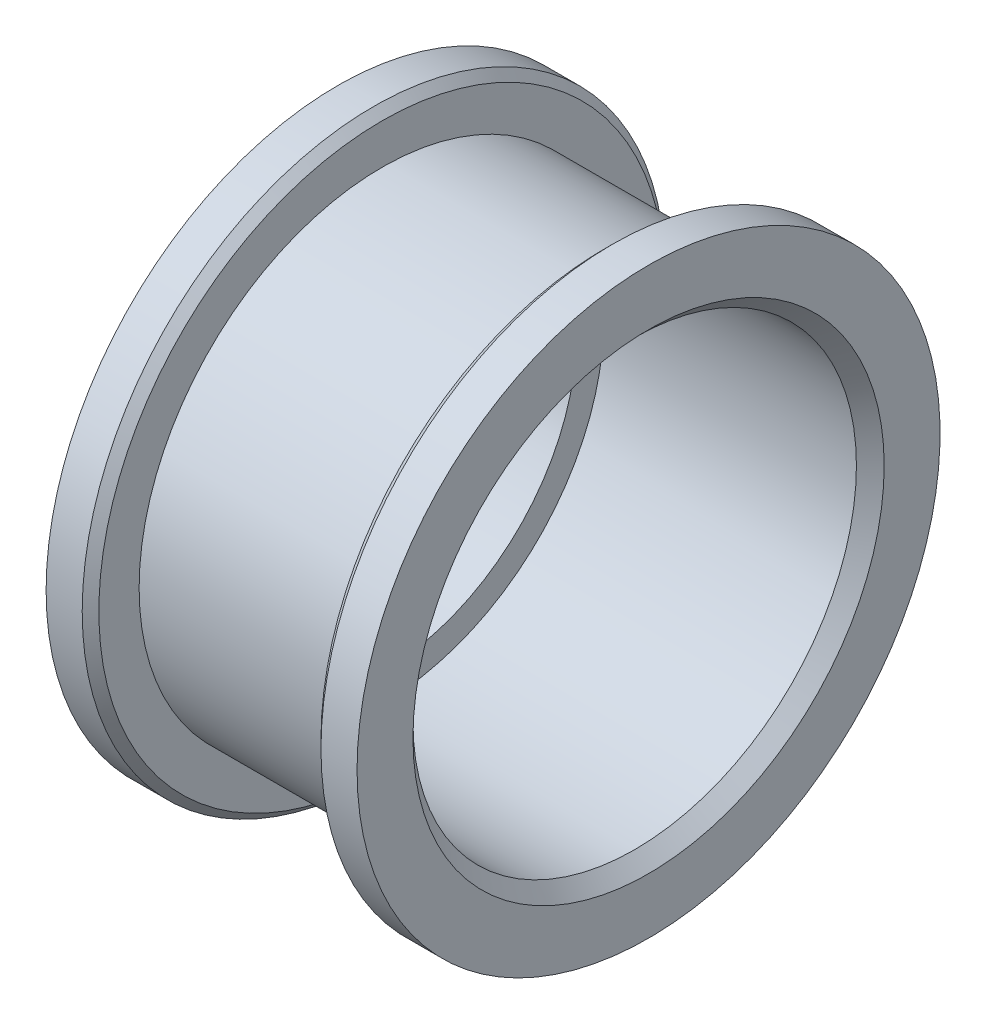
ISO-10303-21;
HEADER;
FILE_DESCRIPTION(('STEP AP214'),'2;1');
FILE_NAME('part.step','',(''),(''),'','','');
FILE_SCHEMA(('AUTOMOTIVE_DESIGN { 1 0 10303 214 1 1 1 1 }'));
ENDSEC;
DATA;
#1=APPLICATION_CONTEXT('core data for automotive mechanical design processes');
#2=APPLICATION_PROTOCOL_DEFINITION('international standard','automotive_design',2000,#1);
#3=PRODUCT_CONTEXT('',#1,'mechanical');
#4=PRODUCT('Part','Part','',(#3));
#5=PRODUCT_RELATED_PRODUCT_CATEGORY('part','',(#4));
#6=PRODUCT_DEFINITION_FORMATION('','',#4);
#7=PRODUCT_DEFINITION_CONTEXT('part definition',#1,'design');
#8=PRODUCT_DEFINITION('design','',#6,#7);
#9=PRODUCT_DEFINITION_SHAPE('','',#8);
#10=(LENGTH_UNIT() NAMED_UNIT(*) SI_UNIT(.MILLI.,.METRE.));
#11=(NAMED_UNIT(*) PLANE_ANGLE_UNIT() SI_UNIT($,.RADIAN.));
#12=(NAMED_UNIT(*) SI_UNIT($,.STERADIAN.) SOLID_ANGLE_UNIT());
#13=UNCERTAINTY_MEASURE_WITH_UNIT(LENGTH_MEASURE(1.E-05),#10,'distance_accuracy_value','');
#14=(GEOMETRIC_REPRESENTATION_CONTEXT(3) GLOBAL_UNCERTAINTY_ASSIGNED_CONTEXT((#13)) GLOBAL_UNIT_ASSIGNED_CONTEXT((#10,
#11,#12)) REPRESENTATION_CONTEXT('',''));
#15=CARTESIAN_POINT('',(0.,0.,0.));
#16=DIRECTION('',(0.,0.,1.));
#17=DIRECTION('',(1.,0.,0.));
#18=AXIS2_PLACEMENT_3D('',#15,#16,#17);
#19=CARTESIAN_POINT('',(6.16,0.,0.));
#20=DIRECTION('',(-1.,0.,0.));
#21=DIRECTION('',(0.,0.,1.));
#22=AXIS2_PLACEMENT_3D('',#19,#20,#21);
#23=CYLINDRICAL_SURFACE('',#22,8.75);
#24=CARTESIAN_POINT('',(4.,0.,0.));
#25=DIRECTION('',(-1.,0.,0.));
#26=DIRECTION('',(0.,0.,1.));
#27=AXIS2_PLACEMENT_3D('',#24,#25,#26);
#28=CIRCLE('',#27,8.75);
#29=CARTESIAN_POINT('',(4.,0.,8.75));
#30=VERTEX_POINT('',#29);
#31=EDGE_CURVE('E53',#30,#30,#28,.F.);
#32=ORIENTED_EDGE('',*,*,#31,.F.);
#33=EDGE_LOOP('',(#32));
#34=FACE_BOUND('',#33,.T.);
#35=CARTESIAN_POINT('',(-4.,0.,0.));
#36=DIRECTION('',(-1.,0.,0.));
#37=DIRECTION('',(0.,0.,1.));
#38=AXIS2_PLACEMENT_3D('',#35,#36,#37);
#39=CIRCLE('',#38,8.75);
#40=CARTESIAN_POINT('',(-4.,0.,8.75));
#41=VERTEX_POINT('',#40);
#42=EDGE_CURVE('E17',#41,#41,#39,.F.);
#43=ORIENTED_EDGE('',*,*,#42,.T.);
#44=EDGE_LOOP('',(#43));
#45=FACE_BOUND('',#44,.T.);
#46=ADVANCED_FACE('F14',(#34,#45),#23,.T.);
#47=CARTESIAN_POINT('',(-4.,0.,0.));
#48=DIRECTION('',(-1.,0.,0.));
#49=DIRECTION('',(0.,0.,1.));
#50=AXIS2_PLACEMENT_3D('',#47,#48,#49);
#51=PLANE('',#50);
#52=ORIENTED_EDGE('',*,*,#42,.F.);
#53=EDGE_LOOP('',(#52));
#54=FACE_BOUND('',#53,.T.);
#55=CARTESIAN_POINT('',(-4.00000000000038,0.,0.));
#56=DIRECTION('',(-1.,0.,0.));
#57=DIRECTION('',(0.,-1.,0.));
#58=AXIS2_PLACEMENT_3D('',#55,#56,#57);
#59=CIRCLE('',#58,10.1999999999996);
#60=CARTESIAN_POINT('',(-4.00000000000038,-10.1999999999996,0.));
#61=VERTEX_POINT('',#60);
#62=EDGE_CURVE('E51',#61,#61,#59,.T.);
#63=ORIENTED_EDGE('',*,*,#62,.F.);
#64=EDGE_LOOP('',(#63));
#65=FACE_BOUND('',#64,.T.);
#66=ADVANCED_FACE('F61',(#54,#65),#51,.F.);
#67=CARTESIAN_POINT('',(4.,0.,0.));
#68=DIRECTION('',(-1.,0.,0.));
#69=DIRECTION('',(0.,0.,1.));
#70=AXIS2_PLACEMENT_3D('',#67,#68,#69);
#71=PLANE('',#70);
#72=ORIENTED_EDGE('',*,*,#31,.T.);
#73=EDGE_LOOP('',(#72));
#74=FACE_BOUND('',#73,.T.);
#75=CARTESIAN_POINT('',(4.00000000000238,0.,0.));
#76=DIRECTION('',(1.,0.,0.));
#77=DIRECTION('',(0.,0.,-1.));
#78=AXIS2_PLACEMENT_3D('',#75,#76,#77);
#79=CIRCLE('',#78,10.1999999999976);
#80=CARTESIAN_POINT('',(4.00000000000238,0.,-10.1999999999976));
#81=VERTEX_POINT('',#80);
#82=EDGE_CURVE('E47',#81,#81,#79,.T.);
#83=ORIENTED_EDGE('',*,*,#82,.F.);
#84=EDGE_LOOP('',(#83));
#85=FACE_BOUND('',#84,.T.);
#86=ADVANCED_FACE('F64',(#74,#85),#71,.T.);
#87=CARTESIAN_POINT('',(-4.29999999999962,0.,0.));
#88=DIRECTION('',(-1.,0.,0.));
#89=DIRECTION('',(0.,-1.,0.));
#90=AXIS2_PLACEMENT_3D('',#87,#88,#89);
#91=CONICAL_SURFACE('',#90,10.5000000000004,0.785398163399998);
#92=ORIENTED_EDGE('',*,*,#62,.T.);
#93=EDGE_LOOP('',(#92));
#94=FACE_BOUND('',#93,.T.);
#95=CARTESIAN_POINT('',(-4.3,0.,0.));
#96=DIRECTION('',(-1.,0.,0.));
#97=DIRECTION('',(0.,0.,1.));
#98=AXIS2_PLACEMENT_3D('',#95,#96,#97);
#99=CIRCLE('',#98,10.5);
#100=CARTESIAN_POINT('',(-4.3,0.,10.5));
#101=VERTEX_POINT('',#100);
#102=EDGE_CURVE('E50',#101,#101,#99,.T.);
#103=ORIENTED_EDGE('',*,*,#102,.F.);
#104=EDGE_LOOP('',(#103));
#105=FACE_BOUND('',#104,.T.);
#106=ADVANCED_FACE('F67',(#94,#105),#91,.T.);
#107=CARTESIAN_POINT('',(4.30000000000161,0.,0.));
#108=DIRECTION('',(1.,0.,0.));
#109=DIRECTION('',(0.,0.,-1.));
#110=AXIS2_PLACEMENT_3D('',#107,#108,#109);
#111=CONICAL_SURFACE('',#110,10.4999999999984,0.785398163400004);
#112=CARTESIAN_POINT('',(4.3,0.,0.));
#113=DIRECTION('',(-1.,0.,0.));
#114=DIRECTION('',(0.,0.,1.));
#115=AXIS2_PLACEMENT_3D('',#112,#113,#114);
#116=CIRCLE('',#115,10.5);
#117=CARTESIAN_POINT('',(4.3,0.,10.5));
#118=VERTEX_POINT('',#117);
#119=EDGE_CURVE('E46',#118,#118,#116,.F.);
#120=ORIENTED_EDGE('',*,*,#119,.F.);
#121=EDGE_LOOP('',(#120));
#122=FACE_BOUND('',#121,.T.);
#123=ORIENTED_EDGE('',*,*,#82,.T.);
#124=EDGE_LOOP('',(#123));
#125=FACE_BOUND('',#124,.T.);
#126=ADVANCED_FACE('F70',(#122,#125),#111,.T.);
#127=CARTESIAN_POINT('',(6.16,0.,0.));
#128=DIRECTION('',(-1.,0.,0.));
#129=DIRECTION('',(0.,0.,1.));
#130=AXIS2_PLACEMENT_3D('',#127,#128,#129);
#131=CYLINDRICAL_SURFACE('',#130,10.5);
#132=CARTESIAN_POINT('',(-5.6,0.,0.));
#133=DIRECTION('',(-1.,0.,0.));
#134=DIRECTION('',(0.,0.,1.));
#135=AXIS2_PLACEMENT_3D('',#132,#133,#134);
#136=CIRCLE('',#135,10.5);
#137=CARTESIAN_POINT('',(-5.6,0.,10.5));
#138=VERTEX_POINT('',#137);
#139=EDGE_CURVE('E43',#138,#138,#136,.T.);
#140=ORIENTED_EDGE('',*,*,#139,.F.);
#141=EDGE_LOOP('',(#140));
#142=FACE_BOUND('',#141,.T.);
#143=ORIENTED_EDGE('',*,*,#102,.T.);
#144=EDGE_LOOP('',(#143));
#145=FACE_BOUND('',#144,.T.);
#146=ADVANCED_FACE('F87',(#142,#145),#131,.T.);
#147=CARTESIAN_POINT('',(6.16,0.,0.));
#148=DIRECTION('',(-1.,0.,0.));
#149=DIRECTION('',(0.,0.,1.));
#150=AXIS2_PLACEMENT_3D('',#147,#148,#149);
#151=CYLINDRICAL_SURFACE('',#150,10.5);
#152=CARTESIAN_POINT('',(5.6,0.,0.));
#153=DIRECTION('',(-1.,0.,0.));
#154=DIRECTION('',(0.,0.,1.));
#155=AXIS2_PLACEMENT_3D('',#152,#153,#154);
#156=CIRCLE('',#155,10.5);
#157=CARTESIAN_POINT('',(5.6,0.,10.5));
#158=VERTEX_POINT('',#157);
#159=EDGE_CURVE('E40',#158,#158,#156,.T.);
#160=ORIENTED_EDGE('',*,*,#159,.T.);
#161=EDGE_LOOP('',(#160));
#162=FACE_BOUND('',#161,.T.);
#163=ORIENTED_EDGE('',*,*,#119,.T.);
#164=EDGE_LOOP('',(#163));
#165=FACE_BOUND('',#164,.T.);
#166=ADVANCED_FACE('F83',(#162,#165),#151,.T.);
#167=CARTESIAN_POINT('',(-5.6,0.,0.));
#168=DIRECTION('',(-1.,0.,0.));
#169=DIRECTION('',(0.,0.,1.));
#170=AXIS2_PLACEMENT_3D('',#167,#168,#169);
#171=PLANE('',#170);
#172=CARTESIAN_POINT('',(-5.6,0.,0.));
#173=DIRECTION('',(-1.,0.,0.));
#174=DIRECTION('',(0.,0.,1.));
#175=AXIS2_PLACEMENT_3D('',#172,#173,#174);
#176=CIRCLE('',#175,7.);
#177=CARTESIAN_POINT('',(-5.6,0.,7.));
#178=VERTEX_POINT('',#177);
#179=EDGE_CURVE('E37',#178,#178,#176,.F.);
#180=ORIENTED_EDGE('',*,*,#179,.T.);
#181=EDGE_LOOP('',(#180));
#182=FACE_BOUND('',#181,.T.);
#183=ORIENTED_EDGE('',*,*,#139,.T.);
#184=EDGE_LOOP('',(#183));
#185=FACE_BOUND('',#184,.T.);
#186=ADVANCED_FACE('F119',(#182,#185),#171,.T.);
#187=CARTESIAN_POINT('',(5.6,0.,0.));
#188=DIRECTION('',(-1.,0.,0.));
#189=DIRECTION('',(0.,0.,1.));
#190=AXIS2_PLACEMENT_3D('',#187,#188,#189);
#191=PLANE('',#190);
#192=CARTESIAN_POINT('',(5.59999999999936,0.,0.));
#193=DIRECTION('',(1.,0.,0.));
#194=DIRECTION('',(0.,0.,-1.));
#195=AXIS2_PLACEMENT_3D('',#192,#193,#194);
#196=CIRCLE('',#195,8.48715000000064);
#197=CARTESIAN_POINT('',(5.59999999999936,0.,-8.48715000000063));
#198=VERTEX_POINT('',#197);
#199=EDGE_CURVE('E34',#198,#198,#196,.F.);
#200=ORIENTED_EDGE('',*,*,#199,.T.);
#201=EDGE_LOOP('',(#200));
#202=FACE_BOUND('',#201,.T.);
#203=ORIENTED_EDGE('',*,*,#159,.F.);
#204=EDGE_LOOP('',(#203));
#205=FACE_BOUND('',#204,.T.);
#206=ADVANCED_FACE('F115',(#202,#205),#191,.F.);
#207=CARTESIAN_POINT('',(6.16,0.,0.));
#208=DIRECTION('',(-1.,0.,0.));
#209=DIRECTION('',(0.,0.,1.));
#210=AXIS2_PLACEMENT_3D('',#207,#208,#209);
#211=CYLINDRICAL_SURFACE('',#210,7.);
#212=CARTESIAN_POINT('',(-4.,0.,0.));
#213=DIRECTION('',(-1.,0.,0.));
#214=DIRECTION('',(0.,0.,1.));
#215=AXIS2_PLACEMENT_3D('',#212,#213,#214);
#216=CIRCLE('',#215,7.);
#217=CARTESIAN_POINT('',(-4.,0.,7.));
#218=VERTEX_POINT('',#217);
#219=EDGE_CURVE('E26',#218,#218,#216,.F.);
#220=ORIENTED_EDGE('',*,*,#219,.T.);
#221=EDGE_LOOP('',(#220));
#222=FACE_BOUND('',#221,.T.);
#223=ORIENTED_EDGE('',*,*,#179,.F.);
#224=EDGE_LOOP('',(#223));
#225=FACE_BOUND('',#224,.T.);
#226=ADVANCED_FACE('F111',(#222,#225),#211,.F.);
#227=CARTESIAN_POINT('',(5.59999999999936,0.,0.));
#228=DIRECTION('',(1.,0.,0.));
#229=DIRECTION('',(0.,0.,-1.));
#230=AXIS2_PLACEMENT_3D('',#227,#228,#229);
#231=CONICAL_SURFACE('',#230,8.48715000000064,0.7853981634);
#232=CARTESIAN_POINT('',(5.1,0.,0.));
#233=DIRECTION('',(-1.,0.,0.));
#234=DIRECTION('',(0.,0.,1.));
#235=AXIS2_PLACEMENT_3D('',#232,#233,#234);
#236=CIRCLE('',#235,7.98715);
#237=CARTESIAN_POINT('',(5.1,0.,7.98715));
#238=VERTEX_POINT('',#237);
#239=EDGE_CURVE('E21',#238,#238,#236,.T.);
#240=ORIENTED_EDGE('',*,*,#239,.T.);
#241=EDGE_LOOP('',(#240));
#242=FACE_BOUND('',#241,.T.);
#243=ORIENTED_EDGE('',*,*,#199,.F.);
#244=EDGE_LOOP('',(#243));
#245=FACE_BOUND('',#244,.T.);
#246=ADVANCED_FACE('F104',(#242,#245),#231,.F.);
#247=CARTESIAN_POINT('',(-4.,0.,0.));
#248=DIRECTION('',(-1.,0.,0.));
#249=DIRECTION('',(0.,0.,1.));
#250=AXIS2_PLACEMENT_3D('',#247,#248,#249);
#251=PLANE('',#250);
#252=ORIENTED_EDGE('',*,*,#219,.F.);
#253=EDGE_LOOP('',(#252));
#254=FACE_BOUND('',#253,.T.);
#255=CARTESIAN_POINT('',(-4.,0.,0.));
#256=DIRECTION('',(-1.,0.,0.));
#257=DIRECTION('',(0.,0.,1.));
#258=AXIS2_PLACEMENT_3D('',#255,#256,#257);
#259=CIRCLE('',#258,7.98715);
#260=CARTESIAN_POINT('',(-4.,0.,7.98715));
#261=VERTEX_POINT('',#260);
#262=EDGE_CURVE('E10',#261,#261,#259,.F.);
#263=ORIENTED_EDGE('',*,*,#262,.T.);
#264=EDGE_LOOP('',(#263));
#265=FACE_BOUND('',#264,.T.);
#266=ADVANCED_FACE('F98',(#254,#265),#251,.F.);
#267=CARTESIAN_POINT('',(6.16,0.,0.));
#268=DIRECTION('',(-1.,0.,0.));
#269=DIRECTION('',(0.,0.,1.));
#270=AXIS2_PLACEMENT_3D('',#267,#268,#269);
#271=CYLINDRICAL_SURFACE('',#270,7.98715);
#272=ORIENTED_EDGE('',*,*,#262,.F.);
#273=EDGE_LOOP('',(#272));
#274=FACE_BOUND('',#273,.T.);
#275=ORIENTED_EDGE('',*,*,#239,.F.);
#276=EDGE_LOOP('',(#275));
#277=FACE_BOUND('',#276,.T.);
#278=ADVANCED_FACE('F96',(#274,#277),#271,.F.);
#279=CLOSED_SHELL('',(#46,#66,#86,#106,#126,#146,#166,#186,#206,#226,#246,#266,#278));
#280=MANIFOLD_SOLID_BREP('B1',#279);
#281=ADVANCED_BREP_SHAPE_REPRESENTATION('',(#18,#280),#14);
#282=SHAPE_DEFINITION_REPRESENTATION(#9,#281);
ENDSEC;
END-ISO-10303-21;
